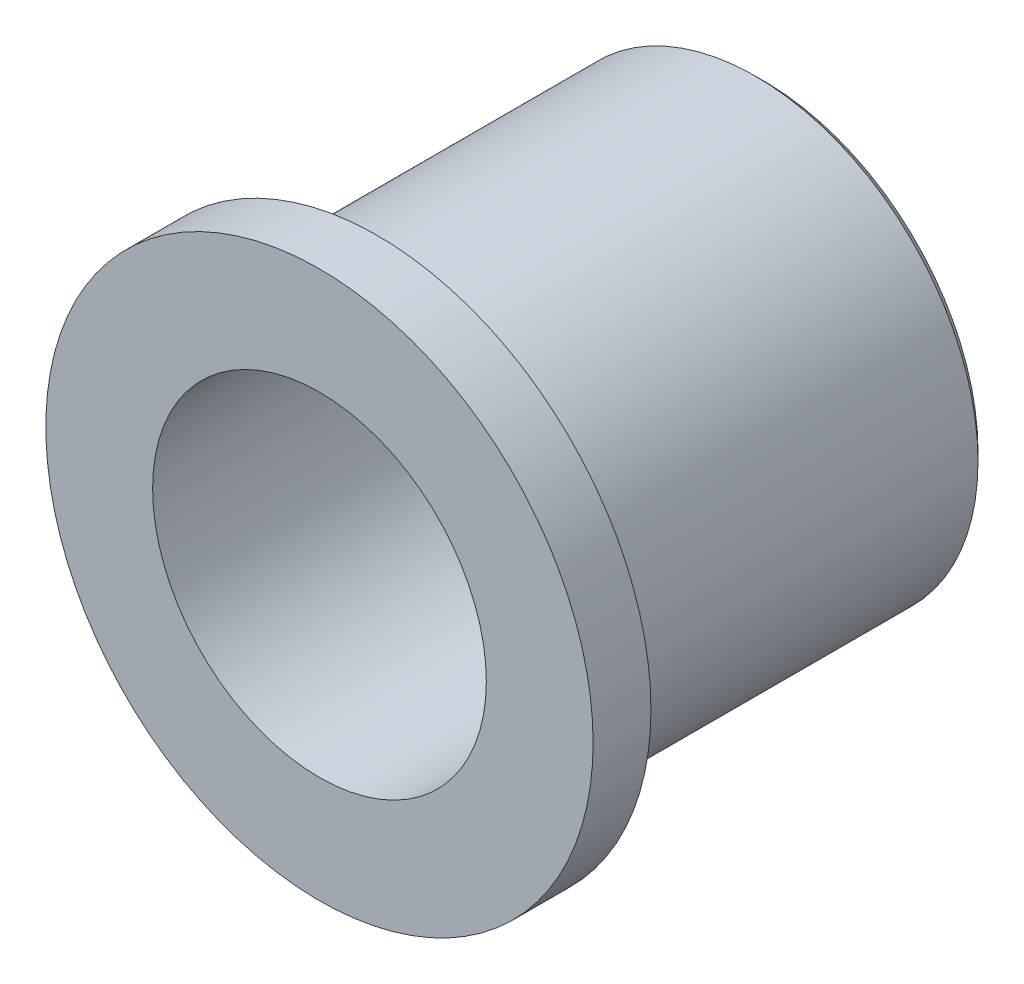
ISO-10303-21;
HEADER;
FILE_DESCRIPTION(('STEP AP214'),'2;1');
FILE_NAME('part.step','',(''),(''),'','','');
FILE_SCHEMA(('AUTOMOTIVE_DESIGN { 1 0 10303 214 1 1 1 1 }'));
ENDSEC;
DATA;
#1=APPLICATION_CONTEXT('core data for automotive mechanical design processes');
#2=APPLICATION_PROTOCOL_DEFINITION('international standard','automotive_design',2000,#1);
#3=PRODUCT_CONTEXT('',#1,'mechanical');
#4=PRODUCT('Part','Part','',(#3));
#5=PRODUCT_RELATED_PRODUCT_CATEGORY('part','',(#4));
#6=PRODUCT_DEFINITION_FORMATION('','',#4);
#7=PRODUCT_DEFINITION_CONTEXT('part definition',#1,'design');
#8=PRODUCT_DEFINITION('design','',#6,#7);
#9=PRODUCT_DEFINITION_SHAPE('','',#8);
#10=(LENGTH_UNIT() NAMED_UNIT(*) SI_UNIT(.MILLI.,.METRE.));
#11=(NAMED_UNIT(*) PLANE_ANGLE_UNIT() SI_UNIT($,.RADIAN.));
#12=(NAMED_UNIT(*) SI_UNIT($,.STERADIAN.) SOLID_ANGLE_UNIT());
#13=UNCERTAINTY_MEASURE_WITH_UNIT(LENGTH_MEASURE(1.E-05),#10,'distance_accuracy_value','');
#14=(GEOMETRIC_REPRESENTATION_CONTEXT(3) GLOBAL_UNCERTAINTY_ASSIGNED_CONTEXT((#13)) GLOBAL_UNIT_ASSIGNED_CONTEXT((#10,
#11,#12)) REPRESENTATION_CONTEXT('',''));
#15=CARTESIAN_POINT('',(0.,0.,0.));
#16=DIRECTION('',(0.,0.,1.));
#17=DIRECTION('',(1.,0.,0.));
#18=AXIS2_PLACEMENT_3D('',#15,#16,#17);
#19=CARTESIAN_POINT('',(0.,12.7,0.));
#20=DIRECTION('',(0.,0.,1.));
#21=DIRECTION('',(1.,0.,0.));
#22=AXIS2_PLACEMENT_3D('',#19,#20,#21);
#23=PLANE('',#22);
#24=CARTESIAN_POINT('',(0.,0.,0.));
#25=DIRECTION('',(0.,0.,1.));
#26=DIRECTION('',(1.,0.,0.));
#27=AXIS2_PLACEMENT_3D('',#24,#25,#26);
#28=CIRCLE('',#27,12.192);
#29=CARTESIAN_POINT('',(12.192,0.,0.));
#30=VERTEX_POINT('',#29);
#31=EDGE_CURVE('E10',#30,#30,#28,.F.);
#32=ORIENTED_EDGE('',*,*,#31,.T.);
#33=EDGE_LOOP('',(#32));
#34=FACE_BOUND('',#33,.T.);
#35=CARTESIAN_POINT('',(0.,0.,0.));
#36=DIRECTION('',(0.,0.,1.));
#37=DIRECTION('',(1.,0.,0.));
#38=AXIS2_PLACEMENT_3D('',#35,#36,#37);
#39=CIRCLE('',#38,9.525);
#40=CARTESIAN_POINT('',(9.525,0.,0.));
#41=VERTEX_POINT('',#40);
#42=EDGE_CURVE('E63',#41,#41,#39,.T.);
#43=ORIENTED_EDGE('',*,*,#42,.T.);
#44=EDGE_LOOP('',(#43));
#45=FACE_BOUND('',#44,.T.);
#46=ADVANCED_FACE('F39',(#34,#45),#23,.F.);
#47=CARTESIAN_POINT('',(0.,0.,25.4));
#48=DIRECTION('',(0.,0.,-1.));
#49=DIRECTION('',(-1.,0.,0.));
#50=AXIS2_PLACEMENT_3D('',#47,#48,#49);
#51=PLANE('',#50);
#52=CARTESIAN_POINT('',(0.,0.,25.4));
#53=DIRECTION('',(0.,0.,1.));
#54=DIRECTION('',(1.,0.,0.));
#55=AXIS2_PLACEMENT_3D('',#52,#53,#54);
#56=CIRCLE('',#55,9.525);
#57=CARTESIAN_POINT('',(9.525,0.,25.4));
#58=VERTEX_POINT('',#57);
#59=EDGE_CURVE('E66',#58,#58,#56,.T.);
#60=ORIENTED_EDGE('',*,*,#59,.F.);
#61=EDGE_LOOP('',(#60));
#62=FACE_BOUND('',#61,.T.);
#63=CARTESIAN_POINT('',(0.,0.,25.4));
#64=DIRECTION('',(0.,0.,1.));
#65=DIRECTION('',(1.,0.,0.));
#66=AXIS2_PLACEMENT_3D('',#63,#64,#65);
#67=CIRCLE('',#66,15.621);
#68=CARTESIAN_POINT('',(15.621,0.,25.4));
#69=VERTEX_POINT('',#68);
#70=EDGE_CURVE('E51',#69,#69,#67,.T.);
#71=ORIENTED_EDGE('',*,*,#70,.T.);
#72=EDGE_LOOP('',(#71));
#73=FACE_BOUND('',#72,.T.);
#74=ADVANCED_FACE('F72',(#62,#73),#51,.F.);
#75=CARTESIAN_POINT('',(0.,0.,0.));
#76=DIRECTION('',(0.,0.,1.));
#77=DIRECTION('',(1.,0.,0.));
#78=AXIS2_PLACEMENT_3D('',#75,#76,#77);
#79=CYLINDRICAL_SURFACE('',#78,15.621);
#80=ORIENTED_EDGE('',*,*,#70,.F.);
#81=EDGE_LOOP('',(#80));
#82=FACE_BOUND('',#81,.T.);
#83=CARTESIAN_POINT('',(0.,0.,22.098));
#84=DIRECTION('',(0.,0.,1.));
#85=DIRECTION('',(1.,0.,0.));
#86=AXIS2_PLACEMENT_3D('',#83,#84,#85);
#87=CIRCLE('',#86,15.621);
#88=CARTESIAN_POINT('',(15.621,0.,22.098));
#89=VERTEX_POINT('',#88);
#90=EDGE_CURVE('E55',#89,#89,#87,.T.);
#91=ORIENTED_EDGE('',*,*,#90,.T.);
#92=EDGE_LOOP('',(#91));
#93=FACE_BOUND('',#92,.T.);
#94=ADVANCED_FACE('F75',(#82,#93),#79,.T.);
#95=CARTESIAN_POINT('',(0.,15.621,22.098));
#96=DIRECTION('',(0.,0.,1.));
#97=DIRECTION('',(1.,0.,0.));
#98=AXIS2_PLACEMENT_3D('',#95,#96,#97);
#99=PLANE('',#98);
#100=ORIENTED_EDGE('',*,*,#90,.F.);
#101=EDGE_LOOP('',(#100));
#102=FACE_BOUND('',#101,.T.);
#103=CARTESIAN_POINT('',(0.,0.,22.098));
#104=DIRECTION('',(0.,0.,1.));
#105=DIRECTION('',(1.,0.,0.));
#106=AXIS2_PLACEMENT_3D('',#103,#104,#105);
#107=CIRCLE('',#106,12.7);
#108=CARTESIAN_POINT('',(12.7,0.,22.098));
#109=VERTEX_POINT('',#108);
#110=EDGE_CURVE('E60',#109,#109,#107,.T.);
#111=ORIENTED_EDGE('',*,*,#110,.T.);
#112=EDGE_LOOP('',(#111));
#113=FACE_BOUND('',#112,.T.);
#114=ADVANCED_FACE('F81',(#102,#113),#99,.F.);
#115=CARTESIAN_POINT('',(0.,0.,0.));
#116=DIRECTION('',(0.,0.,1.));
#117=DIRECTION('',(1.,0.,0.));
#118=AXIS2_PLACEMENT_3D('',#115,#116,#117);
#119=CYLINDRICAL_SURFACE('',#118,12.7);
#120=CARTESIAN_POINT('',(0.,0.,0.508000000000002));
#121=DIRECTION('',(0.,0.,1.));
#122=DIRECTION('',(1.,0.,0.));
#123=AXIS2_PLACEMENT_3D('',#120,#121,#122);
#124=CIRCLE('',#123,12.7);
#125=CARTESIAN_POINT('',(12.7,0.,0.508000000000002));
#126=VERTEX_POINT('',#125);
#127=EDGE_CURVE('E47',#126,#126,#124,.T.);
#128=ORIENTED_EDGE('',*,*,#127,.T.);
#129=EDGE_LOOP('',(#128));
#130=FACE_BOUND('',#129,.T.);
#131=ORIENTED_EDGE('',*,*,#110,.F.);
#132=EDGE_LOOP('',(#131));
#133=FACE_BOUND('',#132,.T.);
#134=ADVANCED_FACE('F87',(#130,#133),#119,.T.);
#135=CARTESIAN_POINT('',(0.,0.,25.4));
#136=DIRECTION('',(0.,0.,1.));
#137=DIRECTION('',(1.,0.,0.));
#138=AXIS2_PLACEMENT_3D('',#135,#136,#137);
#139=CYLINDRICAL_SURFACE('',#138,9.525);
#140=ORIENTED_EDGE('',*,*,#42,.F.);
#141=EDGE_LOOP('',(#140));
#142=FACE_BOUND('',#141,.T.);
#143=ORIENTED_EDGE('',*,*,#59,.T.);
#144=EDGE_LOOP('',(#143));
#145=FACE_BOUND('',#144,.T.);
#146=ADVANCED_FACE('F70',(#142,#145),#139,.F.);
#147=CARTESIAN_POINT('',(0.,0.,0.508000000000002));
#148=DIRECTION('',(0.,0.,1.));
#149=DIRECTION('',(1.,0.,0.));
#150=AXIS2_PLACEMENT_3D('',#147,#148,#149);
#151=CONICAL_SURFACE('',#150,12.7,0.785398163397447);
#152=ORIENTED_EDGE('',*,*,#31,.F.);
#153=EDGE_LOOP('',(#152));
#154=FACE_BOUND('',#153,.T.);
#155=ORIENTED_EDGE('',*,*,#127,.F.);
#156=EDGE_LOOP('',(#155));
#157=FACE_BOUND('',#156,.T.);
#158=ADVANCED_FACE('F42',(#154,#157),#151,.T.);
#159=CLOSED_SHELL('',(#46,#74,#94,#114,#134,#146,#158));
#160=MANIFOLD_SOLID_BREP('B2',#159);
#161=ADVANCED_BREP_SHAPE_REPRESENTATION('',(#18,#160),#14);
#162=SHAPE_DEFINITION_REPRESENTATION(#9,#161);
ENDSEC;
END-ISO-10303-21;
